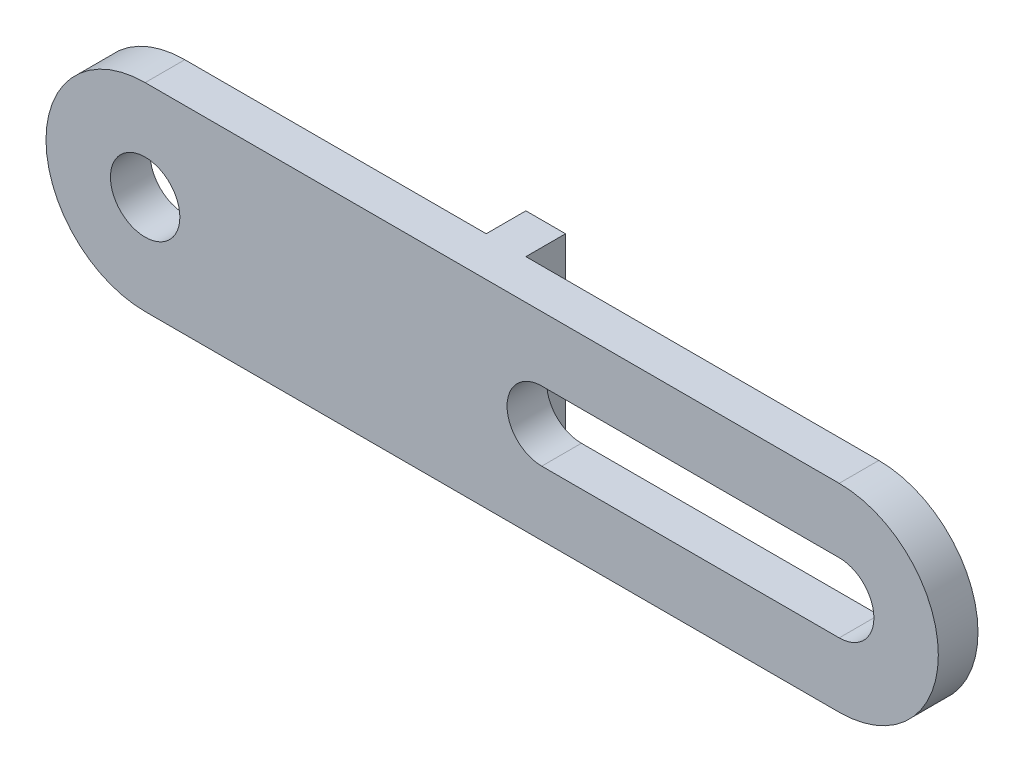
ISO-10303-21;
HEADER;
FILE_DESCRIPTION(('STEP AP214'),'2;1');
FILE_NAME('part.step','',(''),(''),'','','');
FILE_SCHEMA(('AUTOMOTIVE_DESIGN { 1 0 10303 214 1 1 1 1 }'));
ENDSEC;
DATA;
#1=APPLICATION_CONTEXT('core data for automotive mechanical design processes');
#2=APPLICATION_PROTOCOL_DEFINITION('international standard','automotive_design',2000,#1);
#3=PRODUCT_CONTEXT('',#1,'mechanical');
#4=PRODUCT('Part','Part','',(#3));
#5=PRODUCT_RELATED_PRODUCT_CATEGORY('part','',(#4));
#6=PRODUCT_DEFINITION_FORMATION('','',#4);
#7=PRODUCT_DEFINITION_CONTEXT('part definition',#1,'design');
#8=PRODUCT_DEFINITION('design','',#6,#7);
#9=PRODUCT_DEFINITION_SHAPE('','',#8);
#10=(LENGTH_UNIT() NAMED_UNIT(*) SI_UNIT(.MILLI.,.METRE.));
#11=(NAMED_UNIT(*) PLANE_ANGLE_UNIT() SI_UNIT($,.RADIAN.));
#12=(NAMED_UNIT(*) SI_UNIT($,.STERADIAN.) SOLID_ANGLE_UNIT());
#13=UNCERTAINTY_MEASURE_WITH_UNIT(LENGTH_MEASURE(1.E-05),#10,'distance_accuracy_value','');
#14=(GEOMETRIC_REPRESENTATION_CONTEXT(3) GLOBAL_UNCERTAINTY_ASSIGNED_CONTEXT((#13)) GLOBAL_UNIT_ASSIGNED_CONTEXT((#10,
#11,#12)) REPRESENTATION_CONTEXT('',''));
#15=CARTESIAN_POINT('',(0.,0.,0.));
#16=DIRECTION('',(0.,0.,1.));
#17=DIRECTION('',(1.,0.,0.));
#18=AXIS2_PLACEMENT_3D('',#15,#16,#17);
#19=CARTESIAN_POINT('',(0.,0.,0.));
#20=DIRECTION('',(0.,0.,1.));
#21=DIRECTION('',(1.,0.,0.));
#22=AXIS2_PLACEMENT_3D('',#19,#20,#21);
#23=PLANE('',#22);
#24=CARTESIAN_POINT('',(0.,0.,0.));
#25=DIRECTION('',(0.,0.,1.));
#26=DIRECTION('',(1.,0.,0.));
#27=AXIS2_PLACEMENT_3D('',#24,#25,#26);
#28=CIRCLE('',#27,1.75);
#29=CARTESIAN_POINT('',(1.75,0.,0.));
#30=VERTEX_POINT('',#29);
#31=EDGE_CURVE('E179',#30,#30,#28,.T.);
#32=ORIENTED_EDGE('',*,*,#31,.T.);
#33=EDGE_LOOP('',(#32));
#34=FACE_BOUND('',#33,.T.);
#35=DIRECTION('',(0.,1.,0.));
#36=VECTOR('',#35,1.);
#37=CARTESIAN_POINT('',(15.2,5.,0.));
#38=LINE('',#37,#36);
#39=CARTESIAN_POINT('',(15.2,-5.,0.));
#40=VERTEX_POINT('',#39);
#41=CARTESIAN_POINT('',(15.2,5.,0.));
#42=VERTEX_POINT('',#41);
#43=EDGE_CURVE('E48',#40,#42,#38,.T.);
#44=ORIENTED_EDGE('',*,*,#43,.F.);
#45=DIRECTION('',(1.,0.,0.));
#46=VECTOR('',#45,1.);
#47=CARTESIAN_POINT('',(35.,-5.,0.));
#48=LINE('',#47,#46);
#49=CARTESIAN_POINT('',(0.,-5.,0.));
#50=VERTEX_POINT('',#49);
#51=EDGE_CURVE('E200',#50,#40,#48,.T.);
#52=ORIENTED_EDGE('',*,*,#51,.F.);
#53=CARTESIAN_POINT('',(0.,0.,0.));
#54=DIRECTION('',(0.,0.,1.));
#55=DIRECTION('',(1.,0.,0.));
#56=AXIS2_PLACEMENT_3D('',#53,#54,#55);
#57=CIRCLE('',#56,5.);
#58=CARTESIAN_POINT('',(0.,5.,0.));
#59=VERTEX_POINT('',#58);
#60=EDGE_CURVE('E183',#59,#50,#57,.T.);
#61=ORIENTED_EDGE('',*,*,#60,.F.);
#62=DIRECTION('',(-1.,0.,0.));
#63=VECTOR('',#62,1.);
#64=CARTESIAN_POINT('',(0.,5.,0.));
#65=LINE('',#64,#63);
#66=EDGE_CURVE('E53',#42,#59,#65,.T.);
#67=ORIENTED_EDGE('',*,*,#66,.F.);
#68=EDGE_LOOP('',(#44,#52,#61,#67));
#69=FACE_BOUND('',#68,.T.);
#70=ADVANCED_FACE('F33',(#34,#69),#23,.F.);
#71=CARTESIAN_POINT('',(20.,0.,0.));
#72=DIRECTION('',(0.,0.,1.));
#73=DIRECTION('',(1.,0.,0.));
#74=AXIS2_PLACEMENT_3D('',#71,#72,#73);
#75=CIRCLE('',#74,1.75);
#76=CARTESIAN_POINT('',(20.,1.75,0.));
#77=VERTEX_POINT('',#76);
#78=CARTESIAN_POINT('',(20.,-1.75,0.));
#79=VERTEX_POINT('',#78);
#80=EDGE_CURVE('E143',#77,#79,#75,.T.);
#81=ORIENTED_EDGE('',*,*,#80,.T.);
#82=DIRECTION('',(1.,0.,0.));
#83=VECTOR('',#82,1.);
#84=CARTESIAN_POINT('',(20.,-1.75,0.));
#85=LINE('',#84,#83);
#86=CARTESIAN_POINT('',(35.,-1.75,0.));
#87=VERTEX_POINT('',#86);
#88=EDGE_CURVE('E146',#79,#87,#85,.T.);
#89=ORIENTED_EDGE('',*,*,#88,.T.);
#90=CARTESIAN_POINT('',(35.,0.,0.));
#91=DIRECTION('',(0.,0.,1.));
#92=DIRECTION('',(1.,0.,0.));
#93=AXIS2_PLACEMENT_3D('',#90,#91,#92);
#94=CIRCLE('',#93,1.75);
#95=CARTESIAN_POINT('',(35.,1.75,0.));
#96=VERTEX_POINT('',#95);
#97=EDGE_CURVE('E165',#87,#96,#94,.T.);
#98=ORIENTED_EDGE('',*,*,#97,.T.);
#99=DIRECTION('',(-1.,0.,0.));
#100=VECTOR('',#99,1.);
#101=CARTESIAN_POINT('',(20.,1.75,0.));
#102=LINE('',#101,#100);
#103=EDGE_CURVE('E155',#96,#77,#102,.T.);
#104=ORIENTED_EDGE('',*,*,#103,.T.);
#105=EDGE_LOOP('',(#81,#89,#98,#104));
#106=FACE_BOUND('',#105,.T.);
#107=DIRECTION('',(0.,-1.,0.));
#108=VECTOR('',#107,1.);
#109=CARTESIAN_POINT('',(17.2,5.,0.));
#110=LINE('',#109,#108);
#111=CARTESIAN_POINT('',(17.2,5.,0.));
#112=VERTEX_POINT('',#111);
#113=CARTESIAN_POINT('',(17.2,-5.,0.));
#114=VERTEX_POINT('',#113);
#115=EDGE_CURVE('E140',#112,#114,#110,.T.);
#116=ORIENTED_EDGE('',*,*,#115,.F.);
#117=CARTESIAN_POINT('',(35.,5.,0.));
#118=VERTEX_POINT('',#117);
#119=EDGE_CURVE('E190',#118,#112,#65,.T.);
#120=ORIENTED_EDGE('',*,*,#119,.F.);
#121=CARTESIAN_POINT('',(35.,0.,0.));
#122=DIRECTION('',(0.,0.,1.));
#123=DIRECTION('',(-1.,0.,0.));
#124=AXIS2_PLACEMENT_3D('',#121,#122,#123);
#125=CIRCLE('',#124,5.);
#126=CARTESIAN_POINT('',(35.,-5.,0.));
#127=VERTEX_POINT('',#126);
#128=EDGE_CURVE('E202',#127,#118,#125,.T.);
#129=ORIENTED_EDGE('',*,*,#128,.F.);
#130=EDGE_CURVE('E199',#114,#127,#48,.T.);
#131=ORIENTED_EDGE('',*,*,#130,.F.);
#132=EDGE_LOOP('',(#116,#120,#129,#131));
#133=FACE_BOUND('',#132,.T.);
#134=ADVANCED_FACE('F219',(#106,#133),#23,.F.);
#135=CARTESIAN_POINT('',(0.,0.,2.));
#136=DIRECTION('',(0.,0.,1.));
#137=DIRECTION('',(1.,0.,0.));
#138=AXIS2_PLACEMENT_3D('',#135,#136,#137);
#139=PLANE('',#138);
#140=CARTESIAN_POINT('',(0.,0.,2.));
#141=DIRECTION('',(0.,0.,1.));
#142=DIRECTION('',(1.,0.,0.));
#143=AXIS2_PLACEMENT_3D('',#140,#141,#142);
#144=CIRCLE('',#143,5.);
#145=CARTESIAN_POINT('',(0.,5.,2.));
#146=VERTEX_POINT('',#145);
#147=CARTESIAN_POINT('',(0.,-5.,2.));
#148=VERTEX_POINT('',#147);
#149=EDGE_CURVE('E186',#146,#148,#144,.T.);
#150=ORIENTED_EDGE('',*,*,#149,.T.);
#151=DIRECTION('',(1.,0.,0.));
#152=VECTOR('',#151,1.);
#153=CARTESIAN_POINT('',(35.,-5.,2.));
#154=LINE('',#153,#152);
#155=CARTESIAN_POINT('',(35.,-5.,2.));
#156=VERTEX_POINT('',#155);
#157=EDGE_CURVE('E189',#148,#156,#154,.T.);
#158=ORIENTED_EDGE('',*,*,#157,.T.);
#159=CARTESIAN_POINT('',(35.,0.,2.));
#160=DIRECTION('',(0.,0.,1.));
#161=DIRECTION('',(-1.,0.,0.));
#162=AXIS2_PLACEMENT_3D('',#159,#160,#161);
#163=CIRCLE('',#162,5.);
#164=CARTESIAN_POINT('',(35.,5.,2.));
#165=VERTEX_POINT('',#164);
#166=EDGE_CURVE('E192',#156,#165,#163,.T.);
#167=ORIENTED_EDGE('',*,*,#166,.T.);
#168=DIRECTION('',(-1.,0.,0.));
#169=VECTOR('',#168,1.);
#170=CARTESIAN_POINT('',(0.,5.,2.));
#171=LINE('',#170,#169);
#172=EDGE_CURVE('E194',#165,#146,#171,.T.);
#173=ORIENTED_EDGE('',*,*,#172,.T.);
#174=EDGE_LOOP('',(#150,#158,#167,#173));
#175=FACE_BOUND('',#174,.T.);
#176=CARTESIAN_POINT('',(0.,0.,2.));
#177=DIRECTION('',(0.,0.,1.));
#178=DIRECTION('',(1.,0.,0.));
#179=AXIS2_PLACEMENT_3D('',#176,#177,#178);
#180=CIRCLE('',#179,1.75);
#181=CARTESIAN_POINT('',(1.75,0.,2.));
#182=VERTEX_POINT('',#181);
#183=EDGE_CURVE('E180',#182,#182,#180,.T.);
#184=ORIENTED_EDGE('',*,*,#183,.F.);
#185=EDGE_LOOP('',(#184));
#186=FACE_BOUND('',#185,.T.);
#187=DIRECTION('',(1.,0.,0.));
#188=VECTOR('',#187,1.);
#189=CARTESIAN_POINT('',(20.,-1.75,2.));
#190=LINE('',#189,#188);
#191=CARTESIAN_POINT('',(20.,-1.75,2.));
#192=VERTEX_POINT('',#191);
#193=CARTESIAN_POINT('',(35.,-1.75,2.));
#194=VERTEX_POINT('',#193);
#195=EDGE_CURVE('E154',#192,#194,#190,.T.);
#196=ORIENTED_EDGE('',*,*,#195,.F.);
#197=CARTESIAN_POINT('',(20.,0.,2.));
#198=DIRECTION('',(0.,0.,1.));
#199=DIRECTION('',(1.,0.,0.));
#200=AXIS2_PLACEMENT_3D('',#197,#198,#199);
#201=CIRCLE('',#200,1.75);
#202=CARTESIAN_POINT('',(20.,1.75,2.));
#203=VERTEX_POINT('',#202);
#204=EDGE_CURVE('E152',#203,#192,#201,.T.);
#205=ORIENTED_EDGE('',*,*,#204,.F.);
#206=DIRECTION('',(-1.,0.,0.));
#207=VECTOR('',#206,1.);
#208=CARTESIAN_POINT('',(20.,1.75,2.));
#209=LINE('',#208,#207);
#210=CARTESIAN_POINT('',(35.,1.75,2.));
#211=VERTEX_POINT('',#210);
#212=EDGE_CURVE('E160',#211,#203,#209,.T.);
#213=ORIENTED_EDGE('',*,*,#212,.F.);
#214=CARTESIAN_POINT('',(35.,0.,2.));
#215=DIRECTION('',(0.,0.,1.));
#216=DIRECTION('',(1.,0.,0.));
#217=AXIS2_PLACEMENT_3D('',#214,#215,#216);
#218=CIRCLE('',#217,1.75);
#219=EDGE_CURVE('E157',#194,#211,#218,.T.);
#220=ORIENTED_EDGE('',*,*,#219,.F.);
#221=EDGE_LOOP('',(#196,#205,#213,#220));
#222=FACE_BOUND('',#221,.T.);
#223=ADVANCED_FACE('F238',(#175,#186,#222),#139,.T.);
#224=CARTESIAN_POINT('',(0.,0.,2.));
#225=DIRECTION('',(0.,0.,-1.));
#226=DIRECTION('',(-1.,0.,0.));
#227=AXIS2_PLACEMENT_3D('',#224,#225,#226);
#228=CYLINDRICAL_SURFACE('',#227,5.);
#229=ORIENTED_EDGE('',*,*,#60,.T.);
#230=DIRECTION('',(0.,0.,-1.));
#231=VECTOR('',#230,1.);
#232=CARTESIAN_POINT('',(0.,-5.,2.));
#233=LINE('',#232,#231);
#234=EDGE_CURVE('E11',#148,#50,#233,.T.);
#235=ORIENTED_EDGE('',*,*,#234,.F.);
#236=ORIENTED_EDGE('',*,*,#149,.F.);
#237=DIRECTION('',(0.,0.,-1.));
#238=VECTOR('',#237,1.);
#239=CARTESIAN_POINT('',(0.,5.,2.));
#240=LINE('',#239,#238);
#241=EDGE_CURVE('E196',#146,#59,#240,.T.);
#242=ORIENTED_EDGE('',*,*,#241,.T.);
#243=EDGE_LOOP('',(#229,#235,#236,#242));
#244=FACE_BOUND('',#243,.T.);
#245=ADVANCED_FACE('F35',(#244),#228,.T.);
#246=CARTESIAN_POINT('',(35.,-5.,2.));
#247=DIRECTION('',(0.,1.,0.));
#248=DIRECTION('',(0.,0.,1.));
#249=AXIS2_PLACEMENT_3D('',#246,#247,#248);
#250=PLANE('',#249);
#251=ORIENTED_EDGE('',*,*,#51,.T.);
#252=DIRECTION('',(0.,0.,1.));
#253=VECTOR('',#252,1.);
#254=CARTESIAN_POINT('',(15.2,-5.,-2.));
#255=LINE('',#254,#253);
#256=CARTESIAN_POINT('',(15.2,-5.,-2.));
#257=VERTEX_POINT('',#256);
#258=EDGE_CURVE('E227',#257,#40,#255,.T.);
#259=ORIENTED_EDGE('',*,*,#258,.F.);
#260=DIRECTION('',(-1.,0.,0.));
#261=VECTOR('',#260,1.);
#262=CARTESIAN_POINT('',(15.2,-5.,-2.));
#263=LINE('',#262,#261);
#264=CARTESIAN_POINT('',(17.2,-5.,-2.));
#265=VERTEX_POINT('',#264);
#266=EDGE_CURVE('E136',#265,#257,#263,.T.);
#267=ORIENTED_EDGE('',*,*,#266,.F.);
#268=DIRECTION('',(0.,0.,1.));
#269=VECTOR('',#268,1.);
#270=CARTESIAN_POINT('',(17.2,-5.,-2.));
#271=LINE('',#270,#269);
#272=EDGE_CURVE('E148',#265,#114,#271,.T.);
#273=ORIENTED_EDGE('',*,*,#272,.T.);
#274=ORIENTED_EDGE('',*,*,#130,.T.);
#275=DIRECTION('',(0.,0.,-1.));
#276=VECTOR('',#275,1.);
#277=CARTESIAN_POINT('',(35.,-5.,2.));
#278=LINE('',#277,#276);
#279=EDGE_CURVE('E41',#156,#127,#278,.T.);
#280=ORIENTED_EDGE('',*,*,#279,.F.);
#281=ORIENTED_EDGE('',*,*,#157,.F.);
#282=ORIENTED_EDGE('',*,*,#234,.T.);
#283=EDGE_LOOP('',(#251,#259,#267,#273,#274,#280,#281,#282));
#284=FACE_BOUND('',#283,.T.);
#285=ADVANCED_FACE('F232',(#284),#250,.F.);
#286=CARTESIAN_POINT('',(35.,0.,2.));
#287=DIRECTION('',(0.,0.,-1.));
#288=DIRECTION('',(-1.,0.,0.));
#289=AXIS2_PLACEMENT_3D('',#286,#287,#288);
#290=CYLINDRICAL_SURFACE('',#289,5.);
#291=ORIENTED_EDGE('',*,*,#128,.T.);
#292=DIRECTION('',(0.,0.,-1.));
#293=VECTOR('',#292,1.);
#294=CARTESIAN_POINT('',(35.,5.,2.));
#295=LINE('',#294,#293);
#296=EDGE_CURVE('E207',#165,#118,#295,.T.);
#297=ORIENTED_EDGE('',*,*,#296,.F.);
#298=ORIENTED_EDGE('',*,*,#166,.F.);
#299=ORIENTED_EDGE('',*,*,#279,.T.);
#300=EDGE_LOOP('',(#291,#297,#298,#299));
#301=FACE_BOUND('',#300,.T.);
#302=ADVANCED_FACE('F214',(#301),#290,.T.);
#303=CARTESIAN_POINT('',(0.,5.,2.));
#304=DIRECTION('',(0.,-1.,0.));
#305=DIRECTION('',(0.,0.,-1.));
#306=AXIS2_PLACEMENT_3D('',#303,#304,#305);
#307=PLANE('',#306);
#308=ORIENTED_EDGE('',*,*,#119,.T.);
#309=DIRECTION('',(0.,0.,1.));
#310=VECTOR('',#309,1.);
#311=CARTESIAN_POINT('',(17.2,5.,-2.));
#312=LINE('',#311,#310);
#313=CARTESIAN_POINT('',(17.2,5.,-2.));
#314=VERTEX_POINT('',#313);
#315=EDGE_CURVE('E127',#314,#112,#312,.T.);
#316=ORIENTED_EDGE('',*,*,#315,.F.);
#317=DIRECTION('',(1.,0.,0.));
#318=VECTOR('',#317,1.);
#319=CARTESIAN_POINT('',(15.2,5.,-2.));
#320=LINE('',#319,#318);
#321=CARTESIAN_POINT('',(15.2,5.,-2.));
#322=VERTEX_POINT('',#321);
#323=EDGE_CURVE('E120',#322,#314,#320,.T.);
#324=ORIENTED_EDGE('',*,*,#323,.F.);
#325=DIRECTION('',(0.,0.,1.));
#326=VECTOR('',#325,1.);
#327=CARTESIAN_POINT('',(15.2,5.,-2.));
#328=LINE('',#327,#326);
#329=EDGE_CURVE('E125',#322,#42,#328,.T.);
#330=ORIENTED_EDGE('',*,*,#329,.T.);
#331=ORIENTED_EDGE('',*,*,#66,.T.);
#332=ORIENTED_EDGE('',*,*,#241,.F.);
#333=ORIENTED_EDGE('',*,*,#172,.F.);
#334=ORIENTED_EDGE('',*,*,#296,.T.);
#335=EDGE_LOOP('',(#308,#316,#324,#330,#331,#332,#333,#334));
#336=FACE_BOUND('',#335,.T.);
#337=ADVANCED_FACE('F123',(#336),#307,.F.);
#338=CARTESIAN_POINT('',(0.,0.,2.));
#339=DIRECTION('',(0.,0.,-1.));
#340=DIRECTION('',(-1.,0.,0.));
#341=AXIS2_PLACEMENT_3D('',#338,#339,#340);
#342=CYLINDRICAL_SURFACE('',#341,1.75);
#343=ORIENTED_EDGE('',*,*,#183,.T.);
#344=EDGE_LOOP('',(#343));
#345=FACE_BOUND('',#344,.T.);
#346=ORIENTED_EDGE('',*,*,#31,.F.);
#347=EDGE_LOOP('',(#346));
#348=FACE_BOUND('',#347,.T.);
#349=ADVANCED_FACE('F281',(#345,#348),#342,.F.);
#350=CARTESIAN_POINT('',(20.,0.,2.));
#351=DIRECTION('',(0.,0.,-1.));
#352=DIRECTION('',(-1.,0.,0.));
#353=AXIS2_PLACEMENT_3D('',#350,#351,#352);
#354=CYLINDRICAL_SURFACE('',#353,1.75);
#355=ORIENTED_EDGE('',*,*,#80,.F.);
#356=DIRECTION('',(0.,0.,-1.));
#357=VECTOR('',#356,1.);
#358=CARTESIAN_POINT('',(20.,1.75,2.));
#359=LINE('',#358,#357);
#360=EDGE_CURVE('E161',#203,#77,#359,.T.);
#361=ORIENTED_EDGE('',*,*,#360,.F.);
#362=ORIENTED_EDGE('',*,*,#204,.T.);
#363=DIRECTION('',(0.,0.,-1.));
#364=VECTOR('',#363,1.);
#365=CARTESIAN_POINT('',(20.,-1.75,2.));
#366=LINE('',#365,#364);
#367=EDGE_CURVE('E176',#192,#79,#366,.T.);
#368=ORIENTED_EDGE('',*,*,#367,.T.);
#369=EDGE_LOOP('',(#355,#361,#362,#368));
#370=FACE_BOUND('',#369,.T.);
#371=ADVANCED_FACE('F258',(#370),#354,.F.);
#372=CARTESIAN_POINT('',(20.,-1.75,2.));
#373=DIRECTION('',(0.,1.,0.));
#374=DIRECTION('',(0.,0.,1.));
#375=AXIS2_PLACEMENT_3D('',#372,#373,#374);
#376=PLANE('',#375);
#377=ORIENTED_EDGE('',*,*,#88,.F.);
#378=ORIENTED_EDGE('',*,*,#367,.F.);
#379=ORIENTED_EDGE('',*,*,#195,.T.);
#380=DIRECTION('',(0.,0.,-1.));
#381=VECTOR('',#380,1.);
#382=CARTESIAN_POINT('',(35.,-1.75,2.));
#383=LINE('',#382,#381);
#384=EDGE_CURVE('E174',#194,#87,#383,.T.);
#385=ORIENTED_EDGE('',*,*,#384,.T.);
#386=EDGE_LOOP('',(#377,#378,#379,#385));
#387=FACE_BOUND('',#386,.T.);
#388=ADVANCED_FACE('F251',(#387),#376,.T.);
#389=CARTESIAN_POINT('',(35.,0.,2.));
#390=DIRECTION('',(0.,0.,-1.));
#391=DIRECTION('',(-1.,0.,0.));
#392=AXIS2_PLACEMENT_3D('',#389,#390,#391);
#393=CYLINDRICAL_SURFACE('',#392,1.75);
#394=ORIENTED_EDGE('',*,*,#97,.F.);
#395=ORIENTED_EDGE('',*,*,#384,.F.);
#396=ORIENTED_EDGE('',*,*,#219,.T.);
#397=DIRECTION('',(0.,0.,-1.));
#398=VECTOR('',#397,1.);
#399=CARTESIAN_POINT('',(35.,1.75,2.));
#400=LINE('',#399,#398);
#401=EDGE_CURVE('E172',#211,#96,#400,.T.);
#402=ORIENTED_EDGE('',*,*,#401,.T.);
#403=EDGE_LOOP('',(#394,#395,#396,#402));
#404=FACE_BOUND('',#403,.T.);
#405=ADVANCED_FACE('F254',(#404),#393,.F.);
#406=CARTESIAN_POINT('',(20.,1.75,2.));
#407=DIRECTION('',(0.,-1.,0.));
#408=DIRECTION('',(0.,0.,-1.));
#409=AXIS2_PLACEMENT_3D('',#406,#407,#408);
#410=PLANE('',#409);
#411=ORIENTED_EDGE('',*,*,#103,.F.);
#412=ORIENTED_EDGE('',*,*,#401,.F.);
#413=ORIENTED_EDGE('',*,*,#212,.T.);
#414=ORIENTED_EDGE('',*,*,#360,.T.);
#415=EDGE_LOOP('',(#411,#412,#413,#414));
#416=FACE_BOUND('',#415,.T.);
#417=ADVANCED_FACE('F261',(#416),#410,.T.);
#418=CARTESIAN_POINT('',(15.2,5.,-2.));
#419=DIRECTION('',(1.,0.,0.));
#420=DIRECTION('',(0.,0.,-1.));
#421=AXIS2_PLACEMENT_3D('',#418,#419,#420);
#422=PLANE('',#421);
#423=ORIENTED_EDGE('',*,*,#43,.T.);
#424=ORIENTED_EDGE('',*,*,#329,.F.);
#425=DIRECTION('',(0.,1.,0.));
#426=VECTOR('',#425,1.);
#427=CARTESIAN_POINT('',(15.2,5.,-2.));
#428=LINE('',#427,#426);
#429=EDGE_CURVE('E131',#257,#322,#428,.T.);
#430=ORIENTED_EDGE('',*,*,#429,.F.);
#431=ORIENTED_EDGE('',*,*,#258,.T.);
#432=EDGE_LOOP('',(#423,#424,#430,#431));
#433=FACE_BOUND('',#432,.T.);
#434=ADVANCED_FACE('F142',(#433),#422,.F.);
#435=CARTESIAN_POINT('',(17.2,5.,-2.));
#436=DIRECTION('',(-1.,0.,0.));
#437=DIRECTION('',(0.,0.,1.));
#438=AXIS2_PLACEMENT_3D('',#435,#436,#437);
#439=PLANE('',#438);
#440=ORIENTED_EDGE('',*,*,#115,.T.);
#441=ORIENTED_EDGE('',*,*,#272,.F.);
#442=DIRECTION('',(0.,-1.,0.));
#443=VECTOR('',#442,1.);
#444=CARTESIAN_POINT('',(17.2,5.,-2.));
#445=LINE('',#444,#443);
#446=EDGE_CURVE('E130',#314,#265,#445,.T.);
#447=ORIENTED_EDGE('',*,*,#446,.F.);
#448=ORIENTED_EDGE('',*,*,#315,.T.);
#449=EDGE_LOOP('',(#440,#441,#447,#448));
#450=FACE_BOUND('',#449,.T.);
#451=ADVANCED_FACE('F223',(#450),#439,.F.);
#452=CARTESIAN_POINT('',(0.,0.,-2.));
#453=DIRECTION('',(0.,0.,1.));
#454=DIRECTION('',(1.,0.,0.));
#455=AXIS2_PLACEMENT_3D('',#452,#453,#454);
#456=PLANE('',#455);
#457=ORIENTED_EDGE('',*,*,#429,.T.);
#458=ORIENTED_EDGE('',*,*,#323,.T.);
#459=ORIENTED_EDGE('',*,*,#446,.T.);
#460=ORIENTED_EDGE('',*,*,#266,.T.);
#461=EDGE_LOOP('',(#457,#458,#459,#460));
#462=FACE_BOUND('',#461,.T.);
#463=ADVANCED_FACE('F134',(#462),#456,.F.);
#464=CLOSED_SHELL('',(#70,#134,#223,#245,#285,#302,#337,#349,#371,#388,#405,#417,#434,#451,#463));
#465=MANIFOLD_SOLID_BREP('B2',#464);
#466=ADVANCED_BREP_SHAPE_REPRESENTATION('',(#18,#465),#14);
#467=SHAPE_DEFINITION_REPRESENTATION(#9,#466);
ENDSEC;
END-ISO-10303-21;
